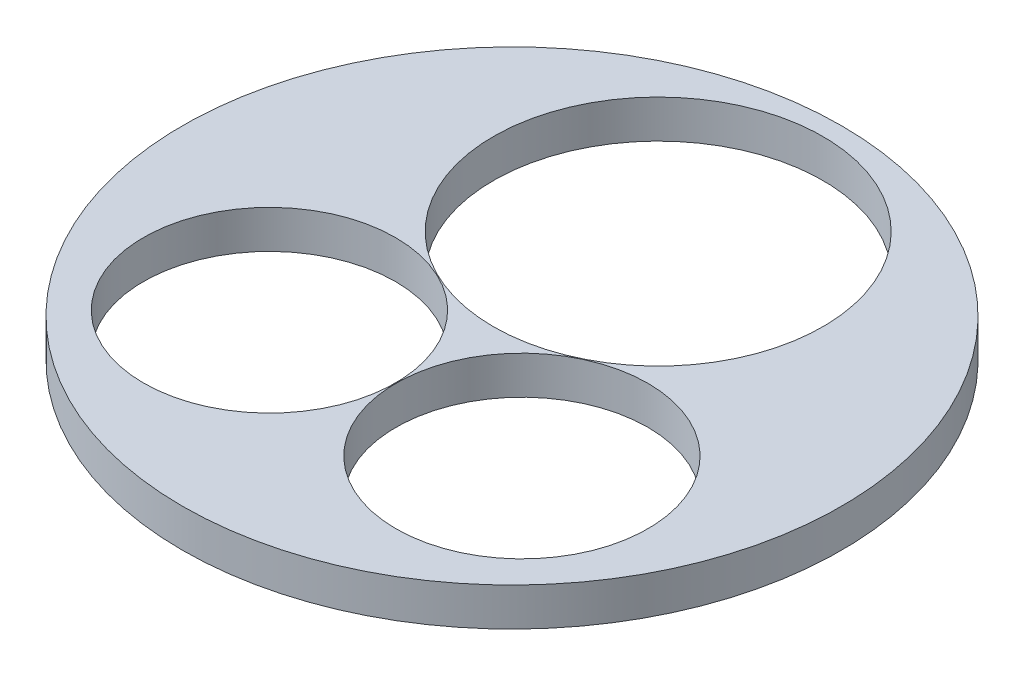
ISO-10303-21;
HEADER;
FILE_DESCRIPTION(('STEP AP214'),'2;1');
FILE_NAME('part.step','',(''),(''),'','','');
FILE_SCHEMA(('AUTOMOTIVE_DESIGN { 1 0 10303 214 1 1 1 1 }'));
ENDSEC;
DATA;
#1=APPLICATION_CONTEXT('core data for automotive mechanical design processes');
#2=APPLICATION_PROTOCOL_DEFINITION('international standard','automotive_design',2000,#1);
#3=PRODUCT_CONTEXT('',#1,'mechanical');
#4=PRODUCT('Part','Part','',(#3));
#5=PRODUCT_RELATED_PRODUCT_CATEGORY('part','',(#4));
#6=PRODUCT_DEFINITION_FORMATION('','',#4);
#7=PRODUCT_DEFINITION_CONTEXT('part definition',#1,'design');
#8=PRODUCT_DEFINITION('design','',#6,#7);
#9=PRODUCT_DEFINITION_SHAPE('','',#8);
#10=(LENGTH_UNIT() NAMED_UNIT(*) SI_UNIT(.MILLI.,.METRE.));
#11=(NAMED_UNIT(*) PLANE_ANGLE_UNIT() SI_UNIT($,.RADIAN.));
#12=(NAMED_UNIT(*) SI_UNIT($,.STERADIAN.) SOLID_ANGLE_UNIT());
#13=UNCERTAINTY_MEASURE_WITH_UNIT(LENGTH_MEASURE(1.E-05),#10,'distance_accuracy_value','');
#14=(GEOMETRIC_REPRESENTATION_CONTEXT(3) GLOBAL_UNCERTAINTY_ASSIGNED_CONTEXT((#13)) GLOBAL_UNIT_ASSIGNED_CONTEXT((#10,
#11,#12)) REPRESENTATION_CONTEXT('',''));
#15=CARTESIAN_POINT('',(0.,0.,0.));
#16=DIRECTION('',(0.,0.,1.));
#17=DIRECTION('',(1.,0.,0.));
#18=AXIS2_PLACEMENT_3D('',#15,#16,#17);
#19=CARTESIAN_POINT('',(0.,100.,0.));
#20=DIRECTION('',(0.,1.,0.));
#21=DIRECTION('',(0.,0.,1.));
#22=AXIS2_PLACEMENT_3D('',#19,#20,#21);
#23=PLANE('',#22);
#24=CARTESIAN_POINT('',(0.,100.,-383.043947182062));
#25=DIRECTION('',(0.,1.,0.));
#26=DIRECTION('',(0.,0.,1.));
#27=AXIS2_PLACEMENT_3D('',#24,#25,#26);
#28=CIRCLE('',#27,431.8);
#29=CARTESIAN_POINT('',(0.,100.,48.7560528179376));
#30=VERTEX_POINT('',#29);
#31=EDGE_CURVE('E53',#30,#30,#28,.T.);
#32=ORIENTED_EDGE('',*,*,#31,.F.);
#33=EDGE_LOOP('',(#32));
#34=FACE_BOUND('',#33,.T.);
#35=CARTESIAN_POINT('',(0.,100.,0.));
#36=DIRECTION('',(0.,1.,0.));
#37=DIRECTION('',(0.,0.,1.));
#38=AXIS2_PLACEMENT_3D('',#35,#36,#37);
#39=CIRCLE('',#38,863.6);
#40=CARTESIAN_POINT('',(0.,100.,863.6));
#41=VERTEX_POINT('',#40);
#42=EDGE_CURVE('E10',#41,#41,#39,.T.);
#43=ORIENTED_EDGE('',*,*,#42,.T.);
#44=EDGE_LOOP('',(#43));
#45=FACE_BOUND('',#44,.T.);
#46=CARTESIAN_POINT('',(330.835,100.,304.8));
#47=DIRECTION('',(0.,1.,0.));
#48=DIRECTION('',(0.,0.,1.));
#49=AXIS2_PLACEMENT_3D('',#46,#47,#48);
#50=CIRCLE('',#49,330.2);
#51=CARTESIAN_POINT('',(330.835,100.,635.));
#52=VERTEX_POINT('',#51);
#53=EDGE_CURVE('E48',#52,#52,#50,.T.);
#54=ORIENTED_EDGE('',*,*,#53,.F.);
#55=EDGE_LOOP('',(#54));
#56=FACE_BOUND('',#55,.T.);
#57=CARTESIAN_POINT('',(-330.835,100.,304.8));
#58=DIRECTION('',(0.,1.,0.));
#59=DIRECTION('',(0.,0.,1.));
#60=AXIS2_PLACEMENT_3D('',#57,#58,#59);
#61=CIRCLE('',#60,330.2);
#62=CARTESIAN_POINT('',(-330.835,100.,635.));
#63=VERTEX_POINT('',#62);
#64=EDGE_CURVE('E59',#63,#63,#61,.T.);
#65=ORIENTED_EDGE('',*,*,#64,.F.);
#66=EDGE_LOOP('',(#65));
#67=FACE_BOUND('',#66,.T.);
#68=ADVANCED_FACE('F37',(#34,#45,#56,#67),#23,.T.);
#69=CARTESIAN_POINT('',(0.,0.,0.));
#70=DIRECTION('',(0.,1.,0.));
#71=DIRECTION('',(0.,0.,1.));
#72=AXIS2_PLACEMENT_3D('',#69,#70,#71);
#73=PLANE('',#72);
#74=CARTESIAN_POINT('',(0.,0.,0.));
#75=DIRECTION('',(0.,1.,0.));
#76=DIRECTION('',(0.,0.,1.));
#77=AXIS2_PLACEMENT_3D('',#74,#75,#76);
#78=CIRCLE('',#77,863.6);
#79=CARTESIAN_POINT('',(0.,0.,863.6));
#80=VERTEX_POINT('',#79);
#81=EDGE_CURVE('E41',#80,#80,#78,.T.);
#82=ORIENTED_EDGE('',*,*,#81,.F.);
#83=EDGE_LOOP('',(#82));
#84=FACE_BOUND('',#83,.T.);
#85=CARTESIAN_POINT('',(330.835,0.,304.8));
#86=DIRECTION('',(0.,1.,0.));
#87=DIRECTION('',(0.,0.,1.));
#88=AXIS2_PLACEMENT_3D('',#85,#86,#87);
#89=CIRCLE('',#88,330.2);
#90=CARTESIAN_POINT('',(330.835,0.,635.));
#91=VERTEX_POINT('',#90);
#92=EDGE_CURVE('E50',#91,#91,#89,.T.);
#93=ORIENTED_EDGE('',*,*,#92,.T.);
#94=EDGE_LOOP('',(#93));
#95=FACE_BOUND('',#94,.T.);
#96=CARTESIAN_POINT('',(0.,0.,-383.043947182062));
#97=DIRECTION('',(0.,1.,0.));
#98=DIRECTION('',(0.,0.,1.));
#99=AXIS2_PLACEMENT_3D('',#96,#97,#98);
#100=CIRCLE('',#99,431.8);
#101=CARTESIAN_POINT('',(0.,0.,48.7560528179376));
#102=VERTEX_POINT('',#101);
#103=EDGE_CURVE('E56',#102,#102,#100,.T.);
#104=ORIENTED_EDGE('',*,*,#103,.T.);
#105=EDGE_LOOP('',(#104));
#106=FACE_BOUND('',#105,.T.);
#107=CARTESIAN_POINT('',(-330.835,0.,304.8));
#108=DIRECTION('',(0.,1.,0.));
#109=DIRECTION('',(0.,0.,1.));
#110=AXIS2_PLACEMENT_3D('',#107,#108,#109);
#111=CIRCLE('',#110,330.2);
#112=CARTESIAN_POINT('',(-330.835,0.,635.));
#113=VERTEX_POINT('',#112);
#114=EDGE_CURVE('E62',#113,#113,#111,.T.);
#115=ORIENTED_EDGE('',*,*,#114,.T.);
#116=EDGE_LOOP('',(#115));
#117=FACE_BOUND('',#116,.T.);
#118=ADVANCED_FACE('F72',(#84,#95,#106,#117),#73,.F.);
#119=CARTESIAN_POINT('',(0.,100.,0.));
#120=DIRECTION('',(0.,-1.,0.));
#121=DIRECTION('',(0.,0.,-1.));
#122=AXIS2_PLACEMENT_3D('',#119,#120,#121);
#123=CYLINDRICAL_SURFACE('',#122,863.6);
#124=ORIENTED_EDGE('',*,*,#42,.F.);
#125=EDGE_LOOP('',(#124));
#126=FACE_BOUND('',#125,.T.);
#127=ORIENTED_EDGE('',*,*,#81,.T.);
#128=EDGE_LOOP('',(#127));
#129=FACE_BOUND('',#128,.T.);
#130=ADVANCED_FACE('F39',(#126,#129),#123,.T.);
#131=CARTESIAN_POINT('',(330.835,100.,304.8));
#132=DIRECTION('',(0.,-1.,0.));
#133=DIRECTION('',(0.,0.,-1.));
#134=AXIS2_PLACEMENT_3D('',#131,#132,#133);
#135=CYLINDRICAL_SURFACE('',#134,330.2);
#136=ORIENTED_EDGE('',*,*,#53,.T.);
#137=EDGE_LOOP('',(#136));
#138=FACE_BOUND('',#137,.T.);
#139=ORIENTED_EDGE('',*,*,#92,.F.);
#140=EDGE_LOOP('',(#139));
#141=FACE_BOUND('',#140,.T.);
#142=ADVANCED_FACE('F81',(#138,#141),#135,.F.);
#143=CARTESIAN_POINT('',(0.,100.,-383.043947182062));
#144=DIRECTION('',(0.,-1.,0.));
#145=DIRECTION('',(0.,0.,-1.));
#146=AXIS2_PLACEMENT_3D('',#143,#144,#145);
#147=CYLINDRICAL_SURFACE('',#146,431.8);
#148=ORIENTED_EDGE('',*,*,#31,.T.);
#149=EDGE_LOOP('',(#148));
#150=FACE_BOUND('',#149,.T.);
#151=ORIENTED_EDGE('',*,*,#103,.F.);
#152=EDGE_LOOP('',(#151));
#153=FACE_BOUND('',#152,.T.);
#154=ADVANCED_FACE('F84',(#150,#153),#147,.F.);
#155=CARTESIAN_POINT('',(-330.835,100.,304.8));
#156=DIRECTION('',(0.,-1.,0.));
#157=DIRECTION('',(0.,0.,-1.));
#158=AXIS2_PLACEMENT_3D('',#155,#156,#157);
#159=CYLINDRICAL_SURFACE('',#158,330.2);
#160=ORIENTED_EDGE('',*,*,#64,.T.);
#161=EDGE_LOOP('',(#160));
#162=FACE_BOUND('',#161,.T.);
#163=ORIENTED_EDGE('',*,*,#114,.F.);
#164=EDGE_LOOP('',(#163));
#165=FACE_BOUND('',#164,.T.);
#166=ADVANCED_FACE('F68',(#162,#165),#159,.F.);
#167=CLOSED_SHELL('',(#68,#118,#130,#142,#154,#166));
#168=MANIFOLD_SOLID_BREP('B2',#167);
#169=ADVANCED_BREP_SHAPE_REPRESENTATION('',(#18,#168),#14);
#170=SHAPE_DEFINITION_REPRESENTATION(#9,#169);
ENDSEC;
END-ISO-10303-21;
